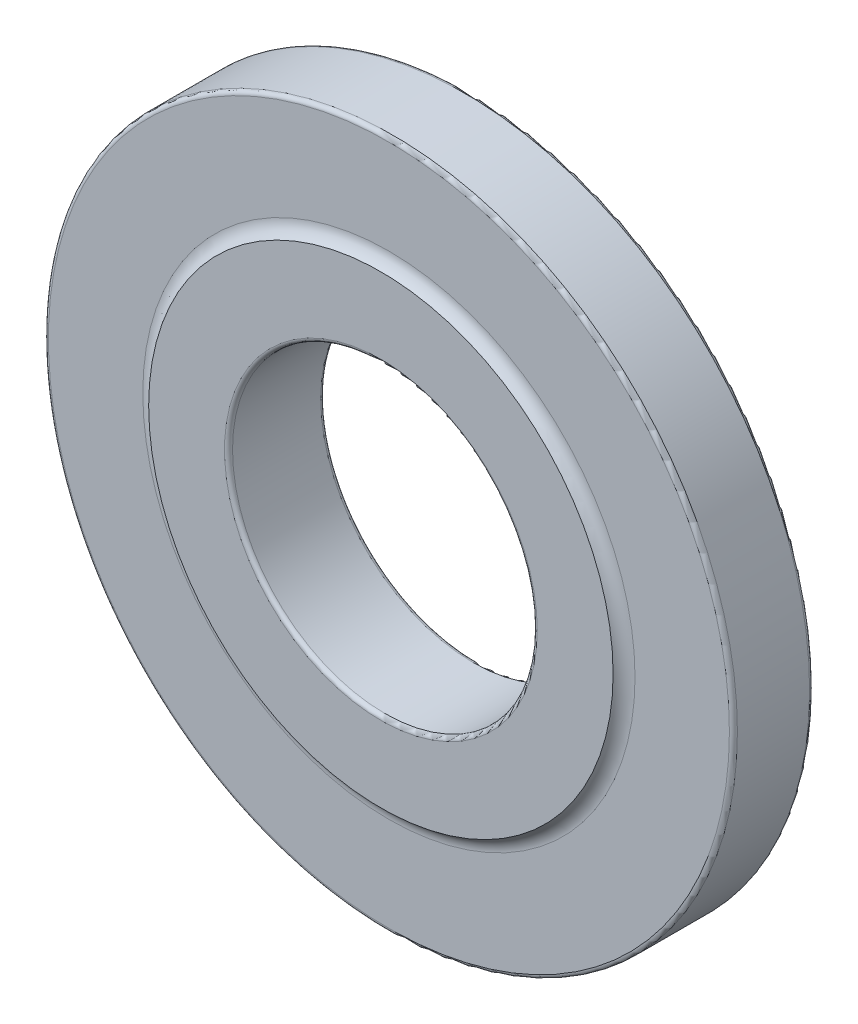
ISO-10303-21;
HEADER;
FILE_DESCRIPTION(('STEP AP214'),'2;1');
FILE_NAME('part.step','',(''),(''),'','','');
FILE_SCHEMA(('AUTOMOTIVE_DESIGN { 1 0 10303 214 1 1 1 1 }'));
ENDSEC;
DATA;
#1=APPLICATION_CONTEXT('core data for automotive mechanical design processes');
#2=APPLICATION_PROTOCOL_DEFINITION('international standard','automotive_design',2000,#1);
#3=PRODUCT_CONTEXT('',#1,'mechanical');
#4=PRODUCT('Part','Part','',(#3));
#5=PRODUCT_RELATED_PRODUCT_CATEGORY('part','',(#4));
#6=PRODUCT_DEFINITION_FORMATION('','',#4);
#7=PRODUCT_DEFINITION_CONTEXT('part definition',#1,'design');
#8=PRODUCT_DEFINITION('design','',#6,#7);
#9=PRODUCT_DEFINITION_SHAPE('','',#8);
#10=(LENGTH_UNIT() NAMED_UNIT(*) SI_UNIT(.MILLI.,.METRE.));
#11=(NAMED_UNIT(*) PLANE_ANGLE_UNIT() SI_UNIT($,.RADIAN.));
#12=(NAMED_UNIT(*) SI_UNIT($,.STERADIAN.) SOLID_ANGLE_UNIT());
#13=UNCERTAINTY_MEASURE_WITH_UNIT(LENGTH_MEASURE(1.E-05),#10,'distance_accuracy_value','');
#14=(GEOMETRIC_REPRESENTATION_CONTEXT(3) GLOBAL_UNCERTAINTY_ASSIGNED_CONTEXT((#13)) GLOBAL_UNIT_ASSIGNED_CONTEXT((#10,
#11,#12)) REPRESENTATION_CONTEXT('',''));
#15=CARTESIAN_POINT('',(0.,0.,0.));
#16=DIRECTION('',(0.,0.,1.));
#17=DIRECTION('',(1.,0.,0.));
#18=AXIS2_PLACEMENT_3D('',#15,#16,#17);
#19=CARTESIAN_POINT('',(0.,0.,-3.));
#20=DIRECTION('',(0.,0.,1.));
#21=DIRECTION('',(1.,0.,0.));
#22=AXIS2_PLACEMENT_3D('',#19,#20,#21);
#23=PLANE('',#22);
#24=CARTESIAN_POINT('',(0.,0.,-3.));
#25=DIRECTION('',(0.,0.,1.));
#26=DIRECTION('',(1.,0.,0.));
#27=AXIS2_PLACEMENT_3D('',#24,#25,#26);
#28=CIRCLE('',#27,9.75);
#29=CARTESIAN_POINT('',(9.75,0.,-3.));
#30=VERTEX_POINT('',#29);
#31=EDGE_CURVE('E10',#30,#30,#28,.T.);
#32=ORIENTED_EDGE('',*,*,#31,.T.);
#33=EDGE_LOOP('',(#32));
#34=FACE_BOUND('',#33,.T.);
#35=CARTESIAN_POINT('',(0.,0.,-3.));
#36=DIRECTION('',(0.,0.,1.));
#37=DIRECTION('',(1.,0.,0.));
#38=AXIS2_PLACEMENT_3D('',#35,#36,#37);
#39=CIRCLE('',#38,14.477835748253);
#40=CARTESIAN_POINT('',(14.477835748253,0.,-3.));
#41=VERTEX_POINT('',#40);
#42=EDGE_CURVE('E85',#41,#41,#39,.T.);
#43=ORIENTED_EDGE('',*,*,#42,.F.);
#44=EDGE_LOOP('',(#43));
#45=FACE_BOUND('',#44,.T.);
#46=ADVANCED_FACE('F37',(#34,#45),#23,.F.);
#47=CARTESIAN_POINT('',(0.,0.,-3.));
#48=DIRECTION('',(0.,0.,1.));
#49=DIRECTION('',(1.,0.,0.));
#50=AXIS2_PLACEMENT_3D('',#47,#48,#49);
#51=CYLINDRICAL_SURFACE('',#50,9.5);
#52=CARTESIAN_POINT('',(0.,0.,2.75));
#53=DIRECTION('',(0.,0.,1.));
#54=DIRECTION('',(1.,0.,0.));
#55=AXIS2_PLACEMENT_3D('',#52,#53,#54);
#56=CIRCLE('',#55,9.5);
#57=CARTESIAN_POINT('',(9.5,0.,2.75));
#58=VERTEX_POINT('',#57);
#59=EDGE_CURVE('E50',#58,#58,#56,.T.);
#60=ORIENTED_EDGE('',*,*,#59,.T.);
#61=EDGE_LOOP('',(#60));
#62=FACE_BOUND('',#61,.T.);
#63=CARTESIAN_POINT('',(0.,0.,-2.75));
#64=DIRECTION('',(0.,0.,1.));
#65=DIRECTION('',(1.,0.,0.));
#66=AXIS2_PLACEMENT_3D('',#63,#64,#65);
#67=CIRCLE('',#66,9.5);
#68=CARTESIAN_POINT('',(9.5,0.,-2.75));
#69=VERTEX_POINT('',#68);
#70=EDGE_CURVE('E55',#69,#69,#67,.F.);
#71=ORIENTED_EDGE('',*,*,#70,.T.);
#72=EDGE_LOOP('',(#71));
#73=FACE_BOUND('',#72,.T.);
#74=ADVANCED_FACE('F126',(#62,#73),#51,.F.);
#75=CARTESIAN_POINT('',(0.,0.,3.));
#76=DIRECTION('',(0.,0.,1.));
#77=DIRECTION('',(1.,0.,0.));
#78=AXIS2_PLACEMENT_3D('',#75,#76,#77);
#79=PLANE('',#78);
#80=CARTESIAN_POINT('',(0.,0.,3.));
#81=DIRECTION('',(0.,0.,1.));
#82=DIRECTION('',(1.,0.,0.));
#83=AXIS2_PLACEMENT_3D('',#80,#81,#82);
#84=CIRCLE('',#83,9.75);
#85=CARTESIAN_POINT('',(9.75,0.,3.));
#86=VERTEX_POINT('',#85);
#87=EDGE_CURVE('E45',#86,#86,#84,.F.);
#88=ORIENTED_EDGE('',*,*,#87,.T.);
#89=EDGE_LOOP('',(#88));
#90=FACE_BOUND('',#89,.T.);
#91=CARTESIAN_POINT('',(0.,0.,3.));
#92=DIRECTION('',(0.,0.,1.));
#93=DIRECTION('',(1.,0.,0.));
#94=AXIS2_PLACEMENT_3D('',#91,#92,#93);
#95=CIRCLE('',#94,14.477835748253);
#96=CARTESIAN_POINT('',(14.477835748253,0.,3.));
#97=VERTEX_POINT('',#96);
#98=EDGE_CURVE('E89',#97,#97,#95,.T.);
#99=ORIENTED_EDGE('',*,*,#98,.T.);
#100=EDGE_LOOP('',(#99));
#101=FACE_BOUND('',#100,.T.);
#102=ADVANCED_FACE('F94',(#90,#101),#79,.T.);
#103=CARTESIAN_POINT('',(0.,0.,-2.5));
#104=DIRECTION('',(0.,0.,1.));
#105=DIRECTION('',(1.,0.,0.));
#106=AXIS2_PLACEMENT_3D('',#103,#104,#105);
#107=CYLINDRICAL_SURFACE('',#106,21.4780636274476);
#108=CARTESIAN_POINT('',(0.,0.,-2.25));
#109=DIRECTION('',(0.,0.,1.));
#110=DIRECTION('',(1.,0.,0.));
#111=AXIS2_PLACEMENT_3D('',#108,#109,#110);
#112=CIRCLE('',#111,21.4780636274476);
#113=CARTESIAN_POINT('',(21.4780636274476,0.,-2.25));
#114=VERTEX_POINT('',#113);
#115=EDGE_CURVE('E77',#114,#114,#112,.T.);
#116=ORIENTED_EDGE('',*,*,#115,.T.);
#117=EDGE_LOOP('',(#116));
#118=FACE_BOUND('',#117,.T.);
#119=CARTESIAN_POINT('',(0.,0.,2.25));
#120=DIRECTION('',(0.,0.,1.));
#121=DIRECTION('',(1.,0.,0.));
#122=AXIS2_PLACEMENT_3D('',#119,#120,#121);
#123=CIRCLE('',#122,21.4780636274476);
#124=CARTESIAN_POINT('',(21.4780636274476,0.,2.25));
#125=VERTEX_POINT('',#124);
#126=EDGE_CURVE('E81',#125,#125,#123,.F.);
#127=ORIENTED_EDGE('',*,*,#126,.T.);
#128=EDGE_LOOP('',(#127));
#129=FACE_BOUND('',#128,.T.);
#130=ADVANCED_FACE('F137',(#118,#129),#107,.T.);
#131=CARTESIAN_POINT('',(0.,0.,-2.5));
#132=DIRECTION('',(0.,0.,1.));
#133=DIRECTION('',(1.,0.,0.));
#134=AXIS2_PLACEMENT_3D('',#131,#132,#133);
#135=PLANE('',#134);
#136=CARTESIAN_POINT('',(0.,0.,-2.5));
#137=DIRECTION('',(0.,0.,1.));
#138=DIRECTION('',(1.,0.,0.));
#139=AXIS2_PLACEMENT_3D('',#136,#137,#138);
#140=CIRCLE('',#139,15.3438611520375);
#141=CARTESIAN_POINT('',(15.3438611520375,0.,-2.5));
#142=VERTEX_POINT('',#141);
#143=EDGE_CURVE('E65',#142,#142,#140,.T.);
#144=ORIENTED_EDGE('',*,*,#143,.T.);
#145=EDGE_LOOP('',(#144));
#146=FACE_BOUND('',#145,.T.);
#147=CARTESIAN_POINT('',(0.,0.,-2.5));
#148=DIRECTION('',(0.,0.,1.));
#149=DIRECTION('',(1.,0.,0.));
#150=AXIS2_PLACEMENT_3D('',#147,#148,#149);
#151=CIRCLE('',#150,21.2280636274476);
#152=CARTESIAN_POINT('',(21.2280636274476,0.,-2.5));
#153=VERTEX_POINT('',#152);
#154=EDGE_CURVE('E73',#153,#153,#151,.F.);
#155=ORIENTED_EDGE('',*,*,#154,.T.);
#156=EDGE_LOOP('',(#155));
#157=FACE_BOUND('',#156,.T.);
#158=ADVANCED_FACE('F108',(#146,#157),#135,.F.);
#159=CARTESIAN_POINT('',(0.,0.,2.5));
#160=DIRECTION('',(0.,0.,1.));
#161=DIRECTION('',(1.,0.,0.));
#162=AXIS2_PLACEMENT_3D('',#159,#160,#161);
#163=PLANE('',#162);
#164=CARTESIAN_POINT('',(0.,0.,2.5));
#165=DIRECTION('',(0.,0.,1.));
#166=DIRECTION('',(1.,0.,0.));
#167=AXIS2_PLACEMENT_3D('',#164,#165,#166);
#168=CIRCLE('',#167,15.3438611520375);
#169=CARTESIAN_POINT('',(15.3438611520375,0.,2.5));
#170=VERTEX_POINT('',#169);
#171=EDGE_CURVE('E61',#170,#170,#168,.F.);
#172=ORIENTED_EDGE('',*,*,#171,.T.);
#173=EDGE_LOOP('',(#172));
#174=FACE_BOUND('',#173,.T.);
#175=CARTESIAN_POINT('',(0.,0.,2.5));
#176=DIRECTION('',(0.,0.,1.));
#177=DIRECTION('',(1.,0.,0.));
#178=AXIS2_PLACEMENT_3D('',#175,#176,#177);
#179=CIRCLE('',#178,21.2280636274476);
#180=CARTESIAN_POINT('',(21.2280636274476,0.,2.5));
#181=VERTEX_POINT('',#180);
#182=EDGE_CURVE('E69',#181,#181,#179,.T.);
#183=ORIENTED_EDGE('',*,*,#182,.T.);
#184=EDGE_LOOP('',(#183));
#185=FACE_BOUND('',#184,.T.);
#186=ADVANCED_FACE('F104',(#174,#185),#163,.T.);
#187=CARTESIAN_POINT('',(0.,0.,-2.25));
#188=DIRECTION('',(0.,0.,1.));
#189=DIRECTION('',(1.,0.,0.));
#190=AXIS2_PLACEMENT_3D('',#187,#188,#189);
#191=TOROIDAL_SURFACE('',#190,21.2280636274476,0.25);
#192=ORIENTED_EDGE('',*,*,#154,.F.);
#193=EDGE_LOOP('',(#192));
#194=FACE_BOUND('',#193,.T.);
#195=ORIENTED_EDGE('',*,*,#115,.F.);
#196=EDGE_LOOP('',(#195));
#197=FACE_BOUND('',#196,.T.);
#198=ADVANCED_FACE('F107',(#194,#197),#191,.T.);
#199=CARTESIAN_POINT('',(0.,0.,2.25));
#200=DIRECTION('',(0.,0.,1.));
#201=DIRECTION('',(1.,0.,0.));
#202=AXIS2_PLACEMENT_3D('',#199,#200,#201);
#203=TOROIDAL_SURFACE('',#202,21.2280636274476,0.25);
#204=ORIENTED_EDGE('',*,*,#126,.F.);
#205=EDGE_LOOP('',(#204));
#206=FACE_BOUND('',#205,.T.);
#207=ORIENTED_EDGE('',*,*,#182,.F.);
#208=EDGE_LOOP('',(#207));
#209=FACE_BOUND('',#208,.T.);
#210=ADVANCED_FACE('F112',(#206,#209),#203,.T.);
#211=CARTESIAN_POINT('',(0.,0.,-3.5));
#212=DIRECTION('',(0.,0.,1.));
#213=DIRECTION('',(1.,0.,0.));
#214=AXIS2_PLACEMENT_3D('',#211,#212,#213);
#215=TOROIDAL_SURFACE('',#214,15.3438611520375,1.);
#216=ORIENTED_EDGE('',*,*,#42,.T.);
#217=EDGE_LOOP('',(#216));
#218=FACE_BOUND('',#217,.T.);
#219=ORIENTED_EDGE('',*,*,#143,.F.);
#220=EDGE_LOOP('',(#219));
#221=FACE_BOUND('',#220,.T.);
#222=ADVANCED_FACE('F100',(#218,#221),#215,.F.);
#223=CARTESIAN_POINT('',(0.,0.,3.5));
#224=DIRECTION('',(0.,0.,1.));
#225=DIRECTION('',(1.,0.,0.));
#226=AXIS2_PLACEMENT_3D('',#223,#224,#225);
#227=TOROIDAL_SURFACE('',#226,15.3438611520375,1.);
#228=ORIENTED_EDGE('',*,*,#98,.F.);
#229=EDGE_LOOP('',(#228));
#230=FACE_BOUND('',#229,.T.);
#231=ORIENTED_EDGE('',*,*,#171,.F.);
#232=EDGE_LOOP('',(#231));
#233=FACE_BOUND('',#232,.T.);
#234=ADVANCED_FACE('F96',(#230,#233),#227,.F.);
#235=CARTESIAN_POINT('',(0.,0.,2.75));
#236=DIRECTION('',(0.,0.,1.));
#237=DIRECTION('',(1.,0.,0.));
#238=AXIS2_PLACEMENT_3D('',#235,#236,#237);
#239=TOROIDAL_SURFACE('',#238,9.75,0.25);
#240=ORIENTED_EDGE('',*,*,#87,.F.);
#241=EDGE_LOOP('',(#240));
#242=FACE_BOUND('',#241,.T.);
#243=ORIENTED_EDGE('',*,*,#59,.F.);
#244=EDGE_LOOP('',(#243));
#245=FACE_BOUND('',#244,.T.);
#246=ADVANCED_FACE('F99',(#242,#245),#239,.T.);
#247=CARTESIAN_POINT('',(0.,0.,-2.75));
#248=DIRECTION('',(0.,0.,1.));
#249=DIRECTION('',(1.,0.,0.));
#250=AXIS2_PLACEMENT_3D('',#247,#248,#249);
#251=TOROIDAL_SURFACE('',#250,9.75,0.25);
#252=ORIENTED_EDGE('',*,*,#70,.F.);
#253=EDGE_LOOP('',(#252));
#254=FACE_BOUND('',#253,.T.);
#255=ORIENTED_EDGE('',*,*,#31,.F.);
#256=EDGE_LOOP('',(#255));
#257=FACE_BOUND('',#256,.T.);
#258=ADVANCED_FACE('F39',(#254,#257),#251,.T.);
#259=CLOSED_SHELL('',(#46,#74,#102,#130,#158,#186,#198,#210,#222,#234,#246,#258));
#260=MANIFOLD_SOLID_BREP('B2',#259);
#261=ADVANCED_BREP_SHAPE_REPRESENTATION('',(#18,#260),#14);
#262=SHAPE_DEFINITION_REPRESENTATION(#9,#261);
ENDSEC;
END-ISO-10303-21;
